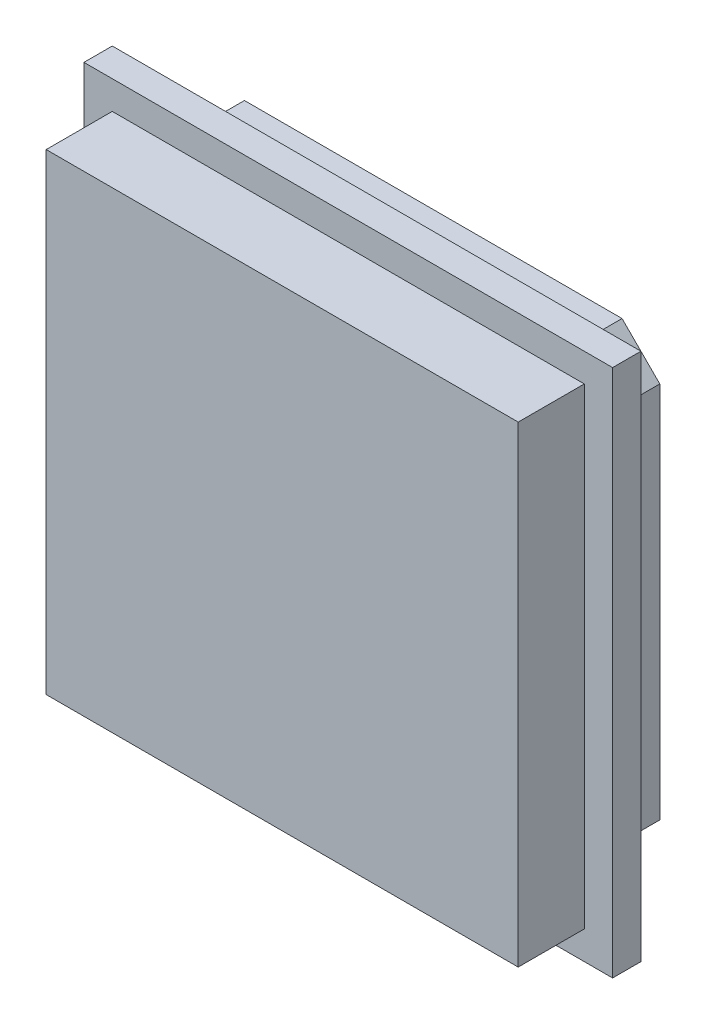
ISO-10303-21;
HEADER;
FILE_DESCRIPTION(('STEP AP214'),'2;1');
FILE_NAME('part.step','',(''),(''),'','','');
FILE_SCHEMA(('AUTOMOTIVE_DESIGN { 1 0 10303 214 1 1 1 1 }'));
ENDSEC;
DATA;
#1=APPLICATION_CONTEXT('core data for automotive mechanical design processes');
#2=APPLICATION_PROTOCOL_DEFINITION('international standard','automotive_design',2000,#1);
#3=PRODUCT_CONTEXT('',#1,'mechanical');
#4=PRODUCT('Part','Part','',(#3));
#5=PRODUCT_RELATED_PRODUCT_CATEGORY('part','',(#4));
#6=PRODUCT_DEFINITION_FORMATION('','',#4);
#7=PRODUCT_DEFINITION_CONTEXT('part definition',#1,'design');
#8=PRODUCT_DEFINITION('design','',#6,#7);
#9=PRODUCT_DEFINITION_SHAPE('','',#8);
#10=(LENGTH_UNIT() NAMED_UNIT(*) SI_UNIT(.MILLI.,.METRE.));
#11=(NAMED_UNIT(*) PLANE_ANGLE_UNIT() SI_UNIT($,.RADIAN.));
#12=(NAMED_UNIT(*) SI_UNIT($,.STERADIAN.) SOLID_ANGLE_UNIT());
#13=UNCERTAINTY_MEASURE_WITH_UNIT(LENGTH_MEASURE(1.E-05),#10,'distance_accuracy_value','');
#14=(GEOMETRIC_REPRESENTATION_CONTEXT(3) GLOBAL_UNCERTAINTY_ASSIGNED_CONTEXT((#13)) GLOBAL_UNIT_ASSIGNED_CONTEXT((#10,
#11,#12)) REPRESENTATION_CONTEXT('',''));
#15=CARTESIAN_POINT('',(0.,0.,0.));
#16=DIRECTION('',(0.,0.,1.));
#17=DIRECTION('',(1.,0.,0.));
#18=AXIS2_PLACEMENT_3D('',#15,#16,#17);
#19=CARTESIAN_POINT('',(0.,0.,4.5));
#20=DIRECTION('',(0.,0.,-1.));
#21=DIRECTION('',(-1.,0.,0.));
#22=AXIS2_PLACEMENT_3D('',#19,#20,#21);
#23=PLANE('',#22);
#24=DIRECTION('',(0.,1.,0.));
#25=VECTOR('',#24,1.);
#26=CARTESIAN_POINT('',(-162.007283518404,38.,4.5));
#27=LINE('',#26,#25);
#28=CARTESIAN_POINT('',(-162.007283518404,10.,4.5));
#29=VERTEX_POINT('',#28);
#30=CARTESIAN_POINT('',(-162.007283518404,38.,4.5));
#31=VERTEX_POINT('',#30);
#32=EDGE_CURVE('E174',#29,#31,#27,.T.);
#33=ORIENTED_EDGE('',*,*,#32,.T.);
#34=DIRECTION('',(-1.,0.,0.));
#35=VECTOR('',#34,1.);
#36=CARTESIAN_POINT('',(-162.007283518404,38.,4.5));
#37=LINE('',#36,#35);
#38=CARTESIAN_POINT('',(-190.007283518404,38.,4.5));
#39=VERTEX_POINT('',#38);
#40=EDGE_CURVE('E177',#31,#39,#37,.T.);
#41=ORIENTED_EDGE('',*,*,#40,.T.);
#42=DIRECTION('',(0.,-1.,0.));
#43=VECTOR('',#42,1.);
#44=CARTESIAN_POINT('',(-190.007283518404,38.,4.5));
#45=LINE('',#44,#43);
#46=CARTESIAN_POINT('',(-190.007283518404,9.99999999999999,4.5));
#47=VERTEX_POINT('',#46);
#48=EDGE_CURVE('E180',#39,#47,#45,.T.);
#49=ORIENTED_EDGE('',*,*,#48,.T.);
#50=DIRECTION('',(1.,0.,0.));
#51=VECTOR('',#50,1.);
#52=CARTESIAN_POINT('',(-162.007283518404,10.,4.5));
#53=LINE('',#52,#51);
#54=EDGE_CURVE('E182',#47,#29,#53,.T.);
#55=ORIENTED_EDGE('',*,*,#54,.T.);
#56=EDGE_LOOP('',(#33,#41,#49,#55));
#57=FACE_BOUND('',#56,.T.);
#58=DIRECTION('',(0.,1.,0.));
#59=VECTOR('',#58,1.);
#60=CARTESIAN_POINT('',(-163.507283518404,36.5,4.5));
#61=LINE('',#60,#59);
#62=CARTESIAN_POINT('',(-163.507283518404,11.5,4.5));
#63=VERTEX_POINT('',#62);
#64=CARTESIAN_POINT('',(-163.507283518404,36.5,4.5));
#65=VERTEX_POINT('',#64);
#66=EDGE_CURVE('E47',#63,#65,#61,.T.);
#67=ORIENTED_EDGE('',*,*,#66,.F.);
#68=DIRECTION('',(1.,0.,0.));
#69=VECTOR('',#68,1.);
#70=CARTESIAN_POINT('',(-163.507283518404,11.5,4.5));
#71=LINE('',#70,#69);
#72=CARTESIAN_POINT('',(-188.507283518404,11.5,4.5));
#73=VERTEX_POINT('',#72);
#74=EDGE_CURVE('E51',#73,#63,#71,.T.);
#75=ORIENTED_EDGE('',*,*,#74,.F.);
#76=DIRECTION('',(0.,-1.,0.));
#77=VECTOR('',#76,1.);
#78=CARTESIAN_POINT('',(-188.507283518404,36.5,4.5));
#79=LINE('',#78,#77);
#80=CARTESIAN_POINT('',(-188.507283518404,36.5,4.5));
#81=VERTEX_POINT('',#80);
#82=EDGE_CURVE('E468',#81,#73,#79,.T.);
#83=ORIENTED_EDGE('',*,*,#82,.F.);
#84=DIRECTION('',(-1.,0.,0.));
#85=VECTOR('',#84,1.);
#86=CARTESIAN_POINT('',(-163.507283518404,36.5,4.5));
#87=LINE('',#86,#85);
#88=EDGE_CURVE('E474',#65,#81,#87,.T.);
#89=ORIENTED_EDGE('',*,*,#88,.F.);
#90=EDGE_LOOP('',(#67,#75,#83,#89));
#91=FACE_BOUND('',#90,.T.);
#92=ADVANCED_FACE('F32',(#57,#91),#23,.F.);
#93=CARTESIAN_POINT('',(-186.007283518404,36.,3.));
#94=DIRECTION('',(0.707106781186548,-0.707106781186548,0.));
#95=DIRECTION('',(0.707106781186548,0.707106781186548,0.));
#96=AXIS2_PLACEMENT_3D('',#93,#94,#95);
#97=PLANE('',#96);
#98=DIRECTION('',(-0.707106781186547,-0.707106781186547,0.));
#99=VECTOR('',#98,1.);
#100=CARTESIAN_POINT('',(-186.007283518404,36.,0.));
#101=LINE('',#100,#99);
#102=CARTESIAN_POINT('',(-186.007283518404,36.,0.));
#103=VERTEX_POINT('',#102);
#104=CARTESIAN_POINT('',(-188.007283518404,34.,0.));
#105=VERTEX_POINT('',#104);
#106=EDGE_CURVE('E200',#103,#105,#101,.T.);
#107=ORIENTED_EDGE('',*,*,#106,.T.);
#108=DIRECTION('',(0.,0.,-1.));
#109=VECTOR('',#108,1.);
#110=CARTESIAN_POINT('',(-188.007283518404,34.,3.));
#111=LINE('',#110,#109);
#112=CARTESIAN_POINT('',(-188.007283518404,34.,3.));
#113=VERTEX_POINT('',#112);
#114=EDGE_CURVE('E11',#113,#105,#111,.T.);
#115=ORIENTED_EDGE('',*,*,#114,.F.);
#116=DIRECTION('',(-0.707106781186547,-0.707106781186547,0.));
#117=VECTOR('',#116,1.);
#118=CARTESIAN_POINT('',(-186.007283518404,36.,3.));
#119=LINE('',#118,#117);
#120=CARTESIAN_POINT('',(-186.007283518404,36.,3.));
#121=VERTEX_POINT('',#120);
#122=EDGE_CURVE('E201',#121,#113,#119,.T.);
#123=ORIENTED_EDGE('',*,*,#122,.F.);
#124=DIRECTION('',(0.,0.,-1.));
#125=VECTOR('',#124,1.);
#126=CARTESIAN_POINT('',(-186.007283518404,36.,3.));
#127=LINE('',#126,#125);
#128=EDGE_CURVE('E226',#121,#103,#127,.T.);
#129=ORIENTED_EDGE('',*,*,#128,.T.);
#130=EDGE_LOOP('',(#107,#115,#123,#129));
#131=FACE_BOUND('',#130,.T.);
#132=ADVANCED_FACE('F34',(#131),#97,.F.);
#133=CARTESIAN_POINT('',(-188.007283518404,34.,3.));
#134=DIRECTION('',(1.,0.,0.));
#135=DIRECTION('',(0.,0.,-1.));
#136=AXIS2_PLACEMENT_3D('',#133,#134,#135);
#137=PLANE('',#136);
#138=DIRECTION('',(0.,-1.,0.));
#139=VECTOR('',#138,1.);
#140=CARTESIAN_POINT('',(-188.007283518404,34.,0.));
#141=LINE('',#140,#139);
#142=CARTESIAN_POINT('',(-188.007283518404,14.,0.));
#143=VERTEX_POINT('',#142);
#144=EDGE_CURVE('E229',#105,#143,#141,.T.);
#145=ORIENTED_EDGE('',*,*,#144,.T.);
#146=DIRECTION('',(0.,0.,-1.));
#147=VECTOR('',#146,1.);
#148=CARTESIAN_POINT('',(-188.007283518404,14.,3.));
#149=LINE('',#148,#147);
#150=CARTESIAN_POINT('',(-188.007283518404,14.,3.));
#151=VERTEX_POINT('',#150);
#152=EDGE_CURVE('E40',#151,#143,#149,.T.);
#153=ORIENTED_EDGE('',*,*,#152,.F.);
#154=DIRECTION('',(0.,-1.,0.));
#155=VECTOR('',#154,1.);
#156=CARTESIAN_POINT('',(-188.007283518404,34.,3.));
#157=LINE('',#156,#155);
#158=EDGE_CURVE('E204',#113,#151,#157,.T.);
#159=ORIENTED_EDGE('',*,*,#158,.F.);
#160=ORIENTED_EDGE('',*,*,#114,.T.);
#161=EDGE_LOOP('',(#145,#153,#159,#160));
#162=FACE_BOUND('',#161,.T.);
#163=ADVANCED_FACE('F281',(#162),#137,.F.);
#164=CARTESIAN_POINT('',(-186.007283518404,12.,3.));
#165=DIRECTION('',(0.707106781186547,0.707106781186548,0.));
#166=DIRECTION('',(-0.707106781186548,0.707106781186547,0.));
#167=AXIS2_PLACEMENT_3D('',#164,#165,#166);
#168=PLANE('',#167);
#169=DIRECTION('',(0.707106781186548,-0.707106781186547,0.));
#170=VECTOR('',#169,1.);
#171=CARTESIAN_POINT('',(-186.007283518404,12.,0.));
#172=LINE('',#171,#170);
#173=CARTESIAN_POINT('',(-186.007283518404,12.,0.));
#174=VERTEX_POINT('',#173);
#175=EDGE_CURVE('E231',#143,#174,#172,.T.);
#176=ORIENTED_EDGE('',*,*,#175,.T.);
#177=DIRECTION('',(0.,0.,-1.));
#178=VECTOR('',#177,1.);
#179=CARTESIAN_POINT('',(-186.007283518404,12.,3.));
#180=LINE('',#179,#178);
#181=CARTESIAN_POINT('',(-186.007283518404,12.,3.));
#182=VERTEX_POINT('',#181);
#183=EDGE_CURVE('E256',#182,#174,#180,.T.);
#184=ORIENTED_EDGE('',*,*,#183,.F.);
#185=DIRECTION('',(0.707106781186548,-0.707106781186547,0.));
#186=VECTOR('',#185,1.);
#187=CARTESIAN_POINT('',(-186.007283518404,12.,3.));
#188=LINE('',#187,#186);
#189=EDGE_CURVE('E208',#151,#182,#188,.T.);
#190=ORIENTED_EDGE('',*,*,#189,.F.);
#191=ORIENTED_EDGE('',*,*,#152,.T.);
#192=EDGE_LOOP('',(#176,#184,#190,#191));
#193=FACE_BOUND('',#192,.T.);
#194=ADVANCED_FACE('F262',(#193),#168,.F.);
#195=CARTESIAN_POINT('',(-166.007283518404,12.,3.));
#196=DIRECTION('',(0.,1.,0.));
#197=DIRECTION('',(-1.,0.,0.));
#198=AXIS2_PLACEMENT_3D('',#195,#196,#197);
#199=PLANE('',#198);
#200=DIRECTION('',(1.,0.,0.));
#201=VECTOR('',#200,1.);
#202=CARTESIAN_POINT('',(-166.007283518404,12.,0.));
#203=LINE('',#202,#201);
#204=CARTESIAN_POINT('',(-166.007283518404,12.,0.));
#205=VERTEX_POINT('',#204);
#206=EDGE_CURVE('E233',#174,#205,#203,.T.);
#207=ORIENTED_EDGE('',*,*,#206,.T.);
#208=DIRECTION('',(0.,0.,-1.));
#209=VECTOR('',#208,1.);
#210=CARTESIAN_POINT('',(-166.007283518404,12.,3.));
#211=LINE('',#210,#209);
#212=CARTESIAN_POINT('',(-166.007283518404,12.,3.));
#213=VERTEX_POINT('',#212);
#214=EDGE_CURVE('E253',#213,#205,#211,.T.);
#215=ORIENTED_EDGE('',*,*,#214,.F.);
#216=DIRECTION('',(1.,0.,0.));
#217=VECTOR('',#216,1.);
#218=CARTESIAN_POINT('',(-166.007283518404,12.,3.));
#219=LINE('',#218,#217);
#220=EDGE_CURVE('E211',#182,#213,#219,.T.);
#221=ORIENTED_EDGE('',*,*,#220,.F.);
#222=ORIENTED_EDGE('',*,*,#183,.T.);
#223=EDGE_LOOP('',(#207,#215,#221,#222));
#224=FACE_BOUND('',#223,.T.);
#225=ADVANCED_FACE('F271',(#224),#199,.F.);
#226=CARTESIAN_POINT('',(-164.007283518404,14.,3.));
#227=DIRECTION('',(-0.707106781186547,0.707106781186548,0.));
#228=DIRECTION('',(-0.707106781186548,-0.707106781186547,0.));
#229=AXIS2_PLACEMENT_3D('',#226,#227,#228);
#230=PLANE('',#229);
#231=DIRECTION('',(0.707106781186548,0.707106781186547,0.));
#232=VECTOR('',#231,1.);
#233=CARTESIAN_POINT('',(-164.007283518404,14.,0.));
#234=LINE('',#233,#232);
#235=CARTESIAN_POINT('',(-164.007283518404,14.,0.));
#236=VERTEX_POINT('',#235);
#237=EDGE_CURVE('E235',#205,#236,#234,.T.);
#238=ORIENTED_EDGE('',*,*,#237,.T.);
#239=DIRECTION('',(0.,0.,-1.));
#240=VECTOR('',#239,1.);
#241=CARTESIAN_POINT('',(-164.007283518404,14.,3.));
#242=LINE('',#241,#240);
#243=CARTESIAN_POINT('',(-164.007283518404,14.,3.));
#244=VERTEX_POINT('',#243);
#245=EDGE_CURVE('E250',#244,#236,#242,.T.);
#246=ORIENTED_EDGE('',*,*,#245,.F.);
#247=DIRECTION('',(0.707106781186548,0.707106781186547,0.));
#248=VECTOR('',#247,1.);
#249=CARTESIAN_POINT('',(-164.007283518404,14.,3.));
#250=LINE('',#249,#248);
#251=EDGE_CURVE('E214',#213,#244,#250,.T.);
#252=ORIENTED_EDGE('',*,*,#251,.F.);
#253=ORIENTED_EDGE('',*,*,#214,.T.);
#254=EDGE_LOOP('',(#238,#246,#252,#253));
#255=FACE_BOUND('',#254,.T.);
#256=ADVANCED_FACE('F275',(#255),#230,.F.);
#257=CARTESIAN_POINT('',(-164.007283518404,34.,3.));
#258=DIRECTION('',(-1.,0.,0.));
#259=DIRECTION('',(0.,0.,1.));
#260=AXIS2_PLACEMENT_3D('',#257,#258,#259);
#261=PLANE('',#260);
#262=DIRECTION('',(0.,1.,0.));
#263=VECTOR('',#262,1.);
#264=CARTESIAN_POINT('',(-164.007283518404,34.,0.));
#265=LINE('',#264,#263);
#266=CARTESIAN_POINT('',(-164.007283518404,34.,0.));
#267=VERTEX_POINT('',#266);
#268=EDGE_CURVE('E237',#236,#267,#265,.T.);
#269=ORIENTED_EDGE('',*,*,#268,.T.);
#270=DIRECTION('',(0.,0.,-1.));
#271=VECTOR('',#270,1.);
#272=CARTESIAN_POINT('',(-164.007283518404,34.,3.));
#273=LINE('',#272,#271);
#274=CARTESIAN_POINT('',(-164.007283518404,34.,3.));
#275=VERTEX_POINT('',#274);
#276=EDGE_CURVE('E247',#275,#267,#273,.T.);
#277=ORIENTED_EDGE('',*,*,#276,.F.);
#278=DIRECTION('',(0.,1.,0.));
#279=VECTOR('',#278,1.);
#280=CARTESIAN_POINT('',(-164.007283518404,34.,3.));
#281=LINE('',#280,#279);
#282=EDGE_CURVE('E217',#244,#275,#281,.T.);
#283=ORIENTED_EDGE('',*,*,#282,.F.);
#284=ORIENTED_EDGE('',*,*,#245,.T.);
#285=EDGE_LOOP('',(#269,#277,#283,#284));
#286=FACE_BOUND('',#285,.T.);
#287=ADVANCED_FACE('F293',(#286),#261,.F.);
#288=CARTESIAN_POINT('',(-164.007283518404,34.,3.));
#289=DIRECTION('',(-0.707106781186548,-0.707106781186548,0.));
#290=DIRECTION('',(0.707106781186548,-0.707106781186548,0.));
#291=AXIS2_PLACEMENT_3D('',#288,#289,#290);
#292=PLANE('',#291);
#293=DIRECTION('',(-0.707106781186547,0.707106781186547,0.));
#294=VECTOR('',#293,1.);
#295=CARTESIAN_POINT('',(-164.007283518404,34.,0.));
#296=LINE('',#295,#294);
#297=CARTESIAN_POINT('',(-166.007283518404,36.,0.));
#298=VERTEX_POINT('',#297);
#299=EDGE_CURVE('E239',#267,#298,#296,.T.);
#300=ORIENTED_EDGE('',*,*,#299,.T.);
#301=DIRECTION('',(0.,0.,-1.));
#302=VECTOR('',#301,1.);
#303=CARTESIAN_POINT('',(-166.007283518404,36.,3.));
#304=LINE('',#303,#302);
#305=CARTESIAN_POINT('',(-166.007283518404,36.,3.));
#306=VERTEX_POINT('',#305);
#307=EDGE_CURVE('E244',#306,#298,#304,.T.);
#308=ORIENTED_EDGE('',*,*,#307,.F.);
#309=DIRECTION('',(-0.707106781186547,0.707106781186547,0.));
#310=VECTOR('',#309,1.);
#311=CARTESIAN_POINT('',(-164.007283518404,34.,3.));
#312=LINE('',#311,#310);
#313=EDGE_CURVE('E220',#275,#306,#312,.T.);
#314=ORIENTED_EDGE('',*,*,#313,.F.);
#315=ORIENTED_EDGE('',*,*,#276,.T.);
#316=EDGE_LOOP('',(#300,#308,#314,#315));
#317=FACE_BOUND('',#316,.T.);
#318=ADVANCED_FACE('F291',(#317),#292,.F.);
#319=CARTESIAN_POINT('',(-166.007283518404,36.,3.));
#320=DIRECTION('',(0.,-1.,0.));
#321=DIRECTION('',(0.,0.,-1.));
#322=AXIS2_PLACEMENT_3D('',#319,#320,#321);
#323=PLANE('',#322);
#324=DIRECTION('',(-1.,0.,0.));
#325=VECTOR('',#324,1.);
#326=CARTESIAN_POINT('',(-166.007283518404,36.,0.));
#327=LINE('',#326,#325);
#328=EDGE_CURVE('E205',#298,#103,#327,.T.);
#329=ORIENTED_EDGE('',*,*,#328,.T.);
#330=ORIENTED_EDGE('',*,*,#128,.F.);
#331=DIRECTION('',(-1.,0.,0.));
#332=VECTOR('',#331,1.);
#333=CARTESIAN_POINT('',(-166.007283518404,36.,3.));
#334=LINE('',#333,#332);
#335=EDGE_CURVE('E223',#306,#121,#334,.T.);
#336=ORIENTED_EDGE('',*,*,#335,.F.);
#337=ORIENTED_EDGE('',*,*,#307,.T.);
#338=EDGE_LOOP('',(#329,#330,#336,#337));
#339=FACE_BOUND('',#338,.T.);
#340=ADVANCED_FACE('F287',(#339),#323,.F.);
#341=CARTESIAN_POINT('',(0.,0.,0.));
#342=DIRECTION('',(0.,0.,-1.));
#343=DIRECTION('',(-1.,0.,0.));
#344=AXIS2_PLACEMENT_3D('',#341,#342,#343);
#345=PLANE('',#344);
#346=ORIENTED_EDGE('',*,*,#106,.F.);
#347=ORIENTED_EDGE('',*,*,#328,.F.);
#348=ORIENTED_EDGE('',*,*,#299,.F.);
#349=ORIENTED_EDGE('',*,*,#268,.F.);
#350=ORIENTED_EDGE('',*,*,#237,.F.);
#351=ORIENTED_EDGE('',*,*,#206,.F.);
#352=ORIENTED_EDGE('',*,*,#175,.F.);
#353=ORIENTED_EDGE('',*,*,#144,.F.);
#354=EDGE_LOOP('',(#346,#347,#348,#349,#350,#351,#352,#353));
#355=FACE_BOUND('',#354,.T.);
#356=ADVANCED_FACE('F267',(#355),#345,.T.);
#357=CARTESIAN_POINT('',(-162.007283518404,38.,4.5));
#358=DIRECTION('',(-1.,0.,0.));
#359=DIRECTION('',(0.,0.,1.));
#360=AXIS2_PLACEMENT_3D('',#357,#358,#359);
#361=PLANE('',#360);
#362=DIRECTION('',(0.,1.,0.));
#363=VECTOR('',#362,1.);
#364=CARTESIAN_POINT('',(-162.007283518404,38.,3.));
#365=LINE('',#364,#363);
#366=CARTESIAN_POINT('',(-162.007283518404,10.,3.));
#367=VERTEX_POINT('',#366);
#368=CARTESIAN_POINT('',(-162.007283518404,38.,3.));
#369=VERTEX_POINT('',#368);
#370=EDGE_CURVE('E165',#367,#369,#365,.T.);
#371=ORIENTED_EDGE('',*,*,#370,.T.);
#372=DIRECTION('',(0.,0.,-1.));
#373=VECTOR('',#372,1.);
#374=CARTESIAN_POINT('',(-162.007283518404,38.,4.5));
#375=LINE('',#374,#373);
#376=EDGE_CURVE('E197',#31,#369,#375,.T.);
#377=ORIENTED_EDGE('',*,*,#376,.F.);
#378=ORIENTED_EDGE('',*,*,#32,.F.);
#379=DIRECTION('',(0.,0.,-1.));
#380=VECTOR('',#379,1.);
#381=CARTESIAN_POINT('',(-162.007283518404,10.,4.5));
#382=LINE('',#381,#380);
#383=EDGE_CURVE('E183',#29,#367,#382,.T.);
#384=ORIENTED_EDGE('',*,*,#383,.T.);
#385=EDGE_LOOP('',(#371,#377,#378,#384));
#386=FACE_BOUND('',#385,.T.);
#387=ADVANCED_FACE('F324',(#386),#361,.F.);
#388=CARTESIAN_POINT('',(-162.007283518404,38.,4.5));
#389=DIRECTION('',(0.,-1.,0.));
#390=DIRECTION('',(0.,0.,-1.));
#391=AXIS2_PLACEMENT_3D('',#388,#389,#390);
#392=PLANE('',#391);
#393=DIRECTION('',(-1.,0.,0.));
#394=VECTOR('',#393,1.);
#395=CARTESIAN_POINT('',(-162.007283518404,38.,3.));
#396=LINE('',#395,#394);
#397=CARTESIAN_POINT('',(-190.007283518404,38.,3.));
#398=VERTEX_POINT('',#397);
#399=EDGE_CURVE('E168',#369,#398,#396,.T.);
#400=ORIENTED_EDGE('',*,*,#399,.T.);
#401=DIRECTION('',(0.,0.,-1.));
#402=VECTOR('',#401,1.);
#403=CARTESIAN_POINT('',(-190.007283518404,38.,4.5));
#404=LINE('',#403,#402);
#405=EDGE_CURVE('E194',#39,#398,#404,.T.);
#406=ORIENTED_EDGE('',*,*,#405,.F.);
#407=ORIENTED_EDGE('',*,*,#40,.F.);
#408=ORIENTED_EDGE('',*,*,#376,.T.);
#409=EDGE_LOOP('',(#400,#406,#407,#408));
#410=FACE_BOUND('',#409,.T.);
#411=ADVANCED_FACE('F320',(#410),#392,.F.);
#412=CARTESIAN_POINT('',(-190.007283518404,38.,4.5));
#413=DIRECTION('',(1.,0.,0.));
#414=DIRECTION('',(0.,0.,-1.));
#415=AXIS2_PLACEMENT_3D('',#412,#413,#414);
#416=PLANE('',#415);
#417=DIRECTION('',(0.,-1.,0.));
#418=VECTOR('',#417,1.);
#419=CARTESIAN_POINT('',(-190.007283518404,38.,3.));
#420=LINE('',#419,#418);
#421=CARTESIAN_POINT('',(-190.007283518404,9.99999999999999,3.));
#422=VERTEX_POINT('',#421);
#423=EDGE_CURVE('E186',#398,#422,#420,.T.);
#424=ORIENTED_EDGE('',*,*,#423,.T.);
#425=DIRECTION('',(0.,0.,-1.));
#426=VECTOR('',#425,1.);
#427=CARTESIAN_POINT('',(-190.007283518404,9.99999999999999,4.5));
#428=LINE('',#427,#426);
#429=EDGE_CURVE('E191',#47,#422,#428,.T.);
#430=ORIENTED_EDGE('',*,*,#429,.F.);
#431=ORIENTED_EDGE('',*,*,#48,.F.);
#432=ORIENTED_EDGE('',*,*,#405,.T.);
#433=EDGE_LOOP('',(#424,#430,#431,#432));
#434=FACE_BOUND('',#433,.T.);
#435=ADVANCED_FACE('F316',(#434),#416,.F.);
#436=CARTESIAN_POINT('',(-162.007283518404,10.,4.5));
#437=DIRECTION('',(0.,1.,0.));
#438=DIRECTION('',(-1.,0.,0.));
#439=AXIS2_PLACEMENT_3D('',#436,#437,#438);
#440=PLANE('',#439);
#441=DIRECTION('',(1.,0.,0.));
#442=VECTOR('',#441,1.);
#443=CARTESIAN_POINT('',(-162.007283518404,10.,3.));
#444=LINE('',#443,#442);
#445=EDGE_CURVE('E178',#422,#367,#444,.T.);
#446=ORIENTED_EDGE('',*,*,#445,.T.);
#447=ORIENTED_EDGE('',*,*,#383,.F.);
#448=ORIENTED_EDGE('',*,*,#54,.F.);
#449=ORIENTED_EDGE('',*,*,#429,.T.);
#450=EDGE_LOOP('',(#446,#447,#448,#449));
#451=FACE_BOUND('',#450,.T.);
#452=ADVANCED_FACE('F313',(#451),#440,.F.);
#453=CARTESIAN_POINT('',(0.,0.,3.));
#454=DIRECTION('',(0.,0.,-1.));
#455=DIRECTION('',(-1.,0.,0.));
#456=AXIS2_PLACEMENT_3D('',#453,#454,#455);
#457=PLANE('',#456);
#458=ORIENTED_EDGE('',*,*,#335,.T.);
#459=ORIENTED_EDGE('',*,*,#122,.T.);
#460=ORIENTED_EDGE('',*,*,#158,.T.);
#461=ORIENTED_EDGE('',*,*,#189,.T.);
#462=ORIENTED_EDGE('',*,*,#220,.T.);
#463=ORIENTED_EDGE('',*,*,#251,.T.);
#464=ORIENTED_EDGE('',*,*,#282,.T.);
#465=ORIENTED_EDGE('',*,*,#313,.T.);
#466=EDGE_LOOP('',(#458,#459,#460,#461,#462,#463,#464,#465));
#467=FACE_BOUND('',#466,.T.);
#468=ORIENTED_EDGE('',*,*,#370,.F.);
#469=ORIENTED_EDGE('',*,*,#445,.F.);
#470=ORIENTED_EDGE('',*,*,#423,.F.);
#471=ORIENTED_EDGE('',*,*,#399,.F.);
#472=EDGE_LOOP('',(#468,#469,#470,#471));
#473=FACE_BOUND('',#472,.T.);
#474=ADVANCED_FACE('F278',(#467,#473),#457,.T.);
#475=CARTESIAN_POINT('',(-163.507283518404,36.5,8.));
#476=DIRECTION('',(-1.,0.,0.));
#477=DIRECTION('',(0.,0.,1.));
#478=AXIS2_PLACEMENT_3D('',#475,#476,#477);
#479=PLANE('',#478);
#480=ORIENTED_EDGE('',*,*,#66,.T.);
#481=DIRECTION('',(0.,0.,-1.));
#482=VECTOR('',#481,1.);
#483=CARTESIAN_POINT('',(-163.507283518404,36.5,8.));
#484=LINE('',#483,#482);
#485=CARTESIAN_POINT('',(-163.507283518404,36.5,8.));
#486=VERTEX_POINT('',#485);
#487=EDGE_CURVE('E148',#486,#65,#484,.T.);
#488=ORIENTED_EDGE('',*,*,#487,.F.);
#489=DIRECTION('',(0.,1.,0.));
#490=VECTOR('',#489,1.);
#491=CARTESIAN_POINT('',(-163.507283518404,36.5,8.));
#492=LINE('',#491,#490);
#493=CARTESIAN_POINT('',(-163.507283518404,11.5,8.));
#494=VERTEX_POINT('',#493);
#495=EDGE_CURVE('E154',#494,#486,#492,.T.);
#496=ORIENTED_EDGE('',*,*,#495,.F.);
#497=DIRECTION('',(0.,0.,-1.));
#498=VECTOR('',#497,1.);
#499=CARTESIAN_POINT('',(-163.507283518404,11.5,8.));
#500=LINE('',#499,#498);
#501=EDGE_CURVE('E466',#494,#63,#500,.T.);
#502=ORIENTED_EDGE('',*,*,#501,.T.);
#503=EDGE_LOOP('',(#480,#488,#496,#502));
#504=FACE_BOUND('',#503,.T.);
#505=ADVANCED_FACE('F164',(#504),#479,.F.);
#506=CARTESIAN_POINT('',(-163.507283518404,36.5,8.));
#507=DIRECTION('',(0.,-1.,0.));
#508=DIRECTION('',(1.,0.,0.));
#509=AXIS2_PLACEMENT_3D('',#506,#507,#508);
#510=PLANE('',#509);
#511=ORIENTED_EDGE('',*,*,#88,.T.);
#512=DIRECTION('',(0.,0.,-1.));
#513=VECTOR('',#512,1.);
#514=CARTESIAN_POINT('',(-188.507283518404,36.5,8.));
#515=LINE('',#514,#513);
#516=CARTESIAN_POINT('',(-188.507283518404,36.5,8.));
#517=VERTEX_POINT('',#516);
#518=EDGE_CURVE('E150',#517,#81,#515,.T.);
#519=ORIENTED_EDGE('',*,*,#518,.F.);
#520=DIRECTION('',(-1.,0.,0.));
#521=VECTOR('',#520,1.);
#522=CARTESIAN_POINT('',(-163.507283518404,36.5,8.));
#523=LINE('',#522,#521);
#524=EDGE_CURVE('E143',#486,#517,#523,.T.);
#525=ORIENTED_EDGE('',*,*,#524,.F.);
#526=ORIENTED_EDGE('',*,*,#487,.T.);
#527=EDGE_LOOP('',(#511,#519,#525,#526));
#528=FACE_BOUND('',#527,.T.);
#529=ADVANCED_FACE('F146',(#528),#510,.F.);
#530=CARTESIAN_POINT('',(-188.507283518404,36.5,8.));
#531=DIRECTION('',(1.,0.,0.));
#532=DIRECTION('',(0.,0.,-1.));
#533=AXIS2_PLACEMENT_3D('',#530,#531,#532);
#534=PLANE('',#533);
#535=ORIENTED_EDGE('',*,*,#82,.T.);
#536=DIRECTION('',(0.,0.,-1.));
#537=VECTOR('',#536,1.);
#538=CARTESIAN_POINT('',(-188.507283518404,11.5,8.));
#539=LINE('',#538,#537);
#540=CARTESIAN_POINT('',(-188.507283518404,11.5,8.));
#541=VERTEX_POINT('',#540);
#542=EDGE_CURVE('E170',#541,#73,#539,.T.);
#543=ORIENTED_EDGE('',*,*,#542,.F.);
#544=DIRECTION('',(0.,-1.,0.));
#545=VECTOR('',#544,1.);
#546=CARTESIAN_POINT('',(-188.507283518404,36.5,8.));
#547=LINE('',#546,#545);
#548=EDGE_CURVE('E153',#517,#541,#547,.T.);
#549=ORIENTED_EDGE('',*,*,#548,.F.);
#550=ORIENTED_EDGE('',*,*,#518,.T.);
#551=EDGE_LOOP('',(#535,#543,#549,#550));
#552=FACE_BOUND('',#551,.T.);
#553=ADVANCED_FACE('F372',(#552),#534,.F.);
#554=CARTESIAN_POINT('',(-163.507283518404,11.5,8.));
#555=DIRECTION('',(0.,1.,0.));
#556=DIRECTION('',(-1.,0.,0.));
#557=AXIS2_PLACEMENT_3D('',#554,#555,#556);
#558=PLANE('',#557);
#559=ORIENTED_EDGE('',*,*,#74,.T.);
#560=ORIENTED_EDGE('',*,*,#501,.F.);
#561=DIRECTION('',(1.,0.,0.));
#562=VECTOR('',#561,1.);
#563=CARTESIAN_POINT('',(-163.507283518404,11.5,8.));
#564=LINE('',#563,#562);
#565=EDGE_CURVE('E159',#541,#494,#564,.T.);
#566=ORIENTED_EDGE('',*,*,#565,.F.);
#567=ORIENTED_EDGE('',*,*,#542,.T.);
#568=EDGE_LOOP('',(#559,#560,#566,#567));
#569=FACE_BOUND('',#568,.T.);
#570=ADVANCED_FACE('F378',(#569),#558,.F.);
#571=CARTESIAN_POINT('',(0.,0.,8.));
#572=DIRECTION('',(0.,0.,-1.));
#573=DIRECTION('',(-1.,0.,0.));
#574=AXIS2_PLACEMENT_3D('',#571,#572,#573);
#575=PLANE('',#574);
#576=ORIENTED_EDGE('',*,*,#495,.T.);
#577=ORIENTED_EDGE('',*,*,#524,.T.);
#578=ORIENTED_EDGE('',*,*,#548,.T.);
#579=ORIENTED_EDGE('',*,*,#565,.T.);
#580=EDGE_LOOP('',(#576,#577,#578,#579));
#581=FACE_BOUND('',#580,.T.);
#582=ADVANCED_FACE('F157',(#581),#575,.F.);
#583=CLOSED_SHELL('',(#92,#132,#163,#194,#225,#256,#287,#318,#340,#356,#387,#411,#435,#452,#474,
#505,#529,#553,#570,#582));
#584=MANIFOLD_SOLID_BREP('B2',#583);
#585=ADVANCED_BREP_SHAPE_REPRESENTATION('',(#18,#584),#14);
#586=SHAPE_DEFINITION_REPRESENTATION(#9,#585);
ENDSEC;
END-ISO-10303-21;
